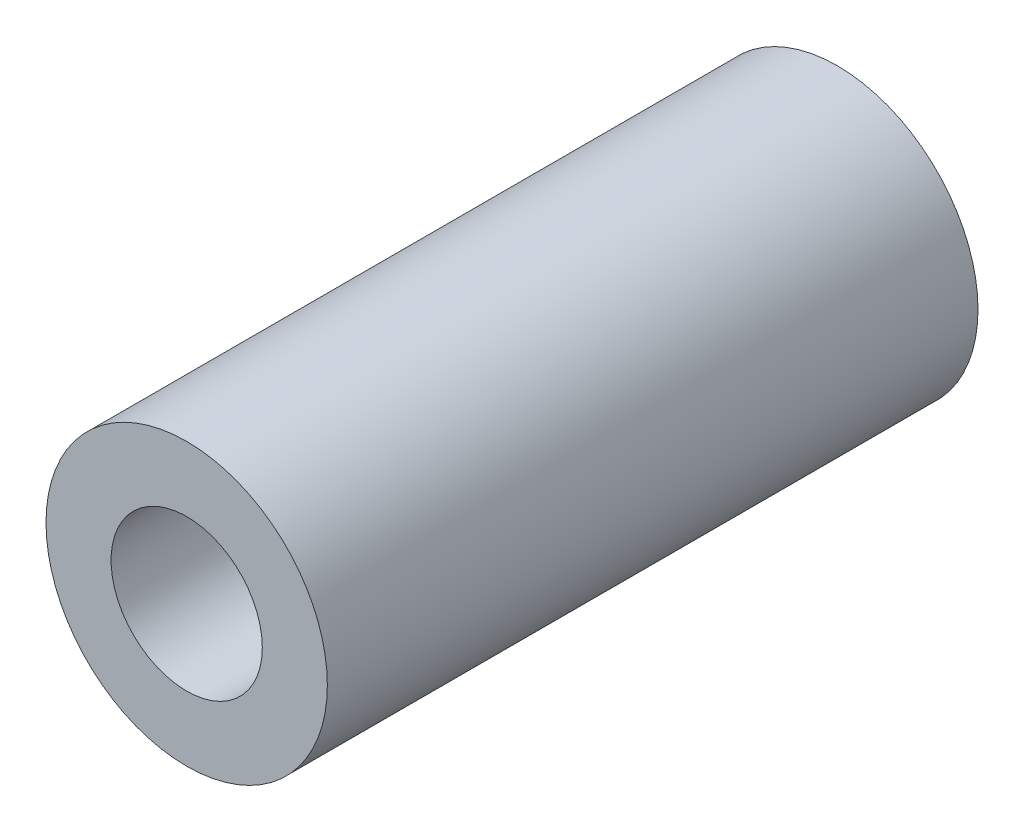
ISO-10303-21;
HEADER;
FILE_DESCRIPTION(('STEP AP214'),'2;1');
FILE_NAME('part.step','',(''),(''),'','','');
FILE_SCHEMA(('AUTOMOTIVE_DESIGN { 1 0 10303 214 1 1 1 1 }'));
ENDSEC;
DATA;
#1=APPLICATION_CONTEXT('core data for automotive mechanical design processes');
#2=APPLICATION_PROTOCOL_DEFINITION('international standard','automotive_design',2000,#1);
#3=PRODUCT_CONTEXT('',#1,'mechanical');
#4=PRODUCT('Part','Part','',(#3));
#5=PRODUCT_RELATED_PRODUCT_CATEGORY('part','',(#4));
#6=PRODUCT_DEFINITION_FORMATION('','',#4);
#7=PRODUCT_DEFINITION_CONTEXT('part definition',#1,'design');
#8=PRODUCT_DEFINITION('design','',#6,#7);
#9=PRODUCT_DEFINITION_SHAPE('','',#8);
#10=(LENGTH_UNIT() NAMED_UNIT(*) SI_UNIT(.MILLI.,.METRE.));
#11=(NAMED_UNIT(*) PLANE_ANGLE_UNIT() SI_UNIT($,.RADIAN.));
#12=(NAMED_UNIT(*) SI_UNIT($,.STERADIAN.) SOLID_ANGLE_UNIT());
#13=UNCERTAINTY_MEASURE_WITH_UNIT(LENGTH_MEASURE(1.E-05),#10,'distance_accuracy_value','');
#14=(GEOMETRIC_REPRESENTATION_CONTEXT(3) GLOBAL_UNCERTAINTY_ASSIGNED_CONTEXT((#13)) GLOBAL_UNIT_ASSIGNED_CONTEXT((#10,
#11,#12)) REPRESENTATION_CONTEXT('',''));
#15=CARTESIAN_POINT('',(0.,0.,0.));
#16=DIRECTION('',(0.,0.,1.));
#17=DIRECTION('',(1.,0.,0.));
#18=AXIS2_PLACEMENT_3D('',#15,#16,#17);
#19=CARTESIAN_POINT('',(0.,0.,18.5));
#20=DIRECTION('',(0.,0.,1.));
#21=DIRECTION('',(1.,0.,0.));
#22=AXIS2_PLACEMENT_3D('',#19,#20,#21);
#23=PLANE('',#22);
#24=CARTESIAN_POINT('',(0.,0.,18.5));
#25=DIRECTION('',(0.,0.,1.));
#26=DIRECTION('',(1.,0.,0.));
#27=AXIS2_PLACEMENT_3D('',#24,#25,#26);
#28=CIRCLE('',#27,4.);
#29=CARTESIAN_POINT('',(4.,0.,18.5));
#30=VERTEX_POINT('',#29);
#31=EDGE_CURVE('E10',#30,#30,#28,.T.);
#32=ORIENTED_EDGE('',*,*,#31,.T.);
#33=EDGE_LOOP('',(#32));
#34=FACE_BOUND('',#33,.T.);
#35=CARTESIAN_POINT('',(0.,0.,18.5));
#36=DIRECTION('',(0.,0.,1.));
#37=DIRECTION('',(1.,0.,0.));
#38=AXIS2_PLACEMENT_3D('',#35,#36,#37);
#39=CIRCLE('',#38,2.15);
#40=CARTESIAN_POINT('',(2.15,0.,18.5));
#41=VERTEX_POINT('',#40);
#42=EDGE_CURVE('E53',#41,#41,#39,.T.);
#43=ORIENTED_EDGE('',*,*,#42,.F.);
#44=EDGE_LOOP('',(#43));
#45=FACE_BOUND('',#44,.T.);
#46=ADVANCED_FACE('F40',(#34,#45),#23,.T.);
#47=CARTESIAN_POINT('',(0.,0.,0.));
#48=DIRECTION('',(0.,0.,1.));
#49=DIRECTION('',(1.,0.,0.));
#50=AXIS2_PLACEMENT_3D('',#47,#48,#49);
#51=PLANE('',#50);
#52=CARTESIAN_POINT('',(0.,0.,0.));
#53=DIRECTION('',(0.,0.,1.));
#54=DIRECTION('',(1.,0.,0.));
#55=AXIS2_PLACEMENT_3D('',#52,#53,#54);
#56=CIRCLE('',#55,4.);
#57=CARTESIAN_POINT('',(4.,0.,0.));
#58=VERTEX_POINT('',#57);
#59=EDGE_CURVE('E44',#58,#58,#56,.T.);
#60=ORIENTED_EDGE('',*,*,#59,.F.);
#61=EDGE_LOOP('',(#60));
#62=FACE_BOUND('',#61,.T.);
#63=CARTESIAN_POINT('',(0.,0.,0.));
#64=DIRECTION('',(0.,0.,1.));
#65=DIRECTION('',(1.,0.,0.));
#66=AXIS2_PLACEMENT_3D('',#63,#64,#65);
#67=CIRCLE('',#66,2.15);
#68=CARTESIAN_POINT('',(2.15,0.,0.));
#69=VERTEX_POINT('',#68);
#70=EDGE_CURVE('E55',#69,#69,#67,.T.);
#71=ORIENTED_EDGE('',*,*,#70,.T.);
#72=EDGE_LOOP('',(#71));
#73=FACE_BOUND('',#72,.T.);
#74=ADVANCED_FACE('F67',(#62,#73),#51,.F.);
#75=CARTESIAN_POINT('',(0.,0.,18.5));
#76=DIRECTION('',(0.,0.,-1.));
#77=DIRECTION('',(-1.,0.,0.));
#78=AXIS2_PLACEMENT_3D('',#75,#76,#77);
#79=CYLINDRICAL_SURFACE('',#78,4.);
#80=ORIENTED_EDGE('',*,*,#31,.F.);
#81=EDGE_LOOP('',(#80));
#82=FACE_BOUND('',#81,.T.);
#83=ORIENTED_EDGE('',*,*,#59,.T.);
#84=EDGE_LOOP('',(#83));
#85=FACE_BOUND('',#84,.T.);
#86=ADVANCED_FACE('F42',(#82,#85),#79,.T.);
#87=CARTESIAN_POINT('',(0.,0.,18.5));
#88=DIRECTION('',(0.,0.,-1.));
#89=DIRECTION('',(-1.,0.,0.));
#90=AXIS2_PLACEMENT_3D('',#87,#88,#89);
#91=CYLINDRICAL_SURFACE('',#90,2.15);
#92=ORIENTED_EDGE('',*,*,#42,.T.);
#93=EDGE_LOOP('',(#92));
#94=FACE_BOUND('',#93,.T.);
#95=ORIENTED_EDGE('',*,*,#70,.F.);
#96=EDGE_LOOP('',(#95));
#97=FACE_BOUND('',#96,.T.);
#98=ADVANCED_FACE('F63',(#94,#97),#91,.F.);
#99=CLOSED_SHELL('',(#46,#74,#86,#98));
#100=MANIFOLD_SOLID_BREP('B2',#99);
#101=ADVANCED_BREP_SHAPE_REPRESENTATION('',(#18,#100),#14);
#102=SHAPE_DEFINITION_REPRESENTATION(#9,#101);
ENDSEC;
END-ISO-10303-21;
